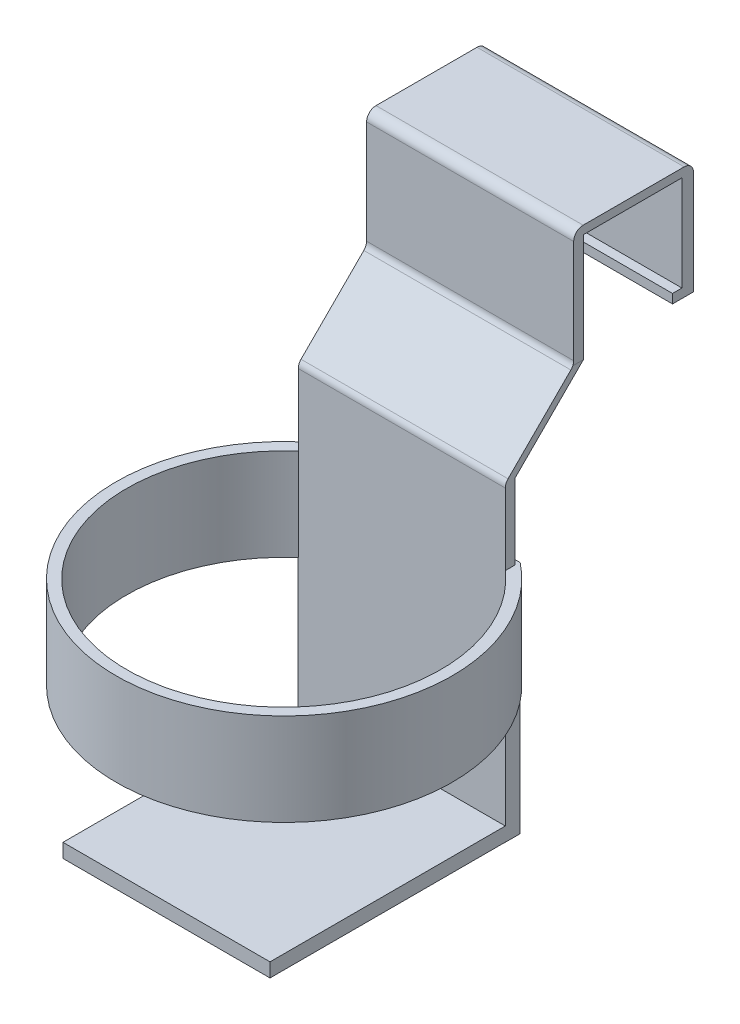
ISO-10303-21;
HEADER;
FILE_DESCRIPTION(('STEP AP214'),'2;1');
FILE_NAME('part.step','',(''),(''),'','','');
FILE_SCHEMA(('AUTOMOTIVE_DESIGN { 1 0 10303 214 1 1 1 1 }'));
ENDSEC;
DATA;
#1=APPLICATION_CONTEXT('core data for automotive mechanical design processes');
#2=APPLICATION_PROTOCOL_DEFINITION('international standard','automotive_design',2000,#1);
#3=PRODUCT_CONTEXT('',#1,'mechanical');
#4=PRODUCT('Part','Part','',(#3));
#5=PRODUCT_RELATED_PRODUCT_CATEGORY('part','',(#4));
#6=PRODUCT_DEFINITION_FORMATION('','',#4);
#7=PRODUCT_DEFINITION_CONTEXT('part definition',#1,'design');
#8=PRODUCT_DEFINITION('design','',#6,#7);
#9=PRODUCT_DEFINITION_SHAPE('','',#8);
#10=(LENGTH_UNIT() NAMED_UNIT(*) SI_UNIT(.MILLI.,.METRE.));
#11=(NAMED_UNIT(*) PLANE_ANGLE_UNIT() SI_UNIT($,.RADIAN.));
#12=(NAMED_UNIT(*) SI_UNIT($,.STERADIAN.) SOLID_ANGLE_UNIT());
#13=UNCERTAINTY_MEASURE_WITH_UNIT(LENGTH_MEASURE(1.E-05),#10,'distance_accuracy_value','');
#14=(GEOMETRIC_REPRESENTATION_CONTEXT(3) GLOBAL_UNCERTAINTY_ASSIGNED_CONTEXT((#13)) GLOBAL_UNIT_ASSIGNED_CONTEXT((#10,
#11,#12)) REPRESENTATION_CONTEXT('',''));
#15=CARTESIAN_POINT('',(0.,0.,0.));
#16=DIRECTION('',(0.,0.,1.));
#17=DIRECTION('',(1.,0.,0.));
#18=AXIS2_PLACEMENT_3D('',#15,#16,#17);
#19=CARTESIAN_POINT('',(0.,36.83,0.));
#20=DIRECTION('',(0.,0.,-1.));
#21=DIRECTION('',(-1.,0.,0.));
#22=AXIS2_PLACEMENT_3D('',#19,#20,#21);
#23=PLANE('',#22);
#24=DIRECTION('',(-1.,0.,0.));
#25=VECTOR('',#24,1.);
#26=CARTESIAN_POINT('',(55.9018002723752,8.81079470941692,0.));
#27=LINE('',#26,#25);
#28=CARTESIAN_POINT('',(55.9018002723752,8.81079470941692,0.));
#29=VERTEX_POINT('',#28);
#30=CARTESIAN_POINT('',(0.,8.81079470941692,0.));
#31=VERTEX_POINT('',#30);
#32=EDGE_CURVE('E251',#29,#31,#27,.T.);
#33=ORIENTED_EDGE('',*,*,#32,.F.);
#34=DIRECTION('',(0.,-1.,0.));
#35=VECTOR('',#34,1.);
#36=CARTESIAN_POINT('',(55.9018002723752,36.83,0.));
#37=LINE('',#36,#35);
#38=CARTESIAN_POINT('',(55.9018002723752,34.5712890129582,0.));
#39=VERTEX_POINT('',#38);
#40=EDGE_CURVE('E258',#39,#29,#37,.T.);
#41=ORIENTED_EDGE('',*,*,#40,.F.);
#42=DIRECTION('',(1.,0.,0.));
#43=VECTOR('',#42,1.);
#44=CARTESIAN_POINT('',(0.,34.5712890129582,0.));
#45=LINE('',#44,#43);
#46=CARTESIAN_POINT('',(0.,34.5712890129582,0.));
#47=VERTEX_POINT('',#46);
#48=EDGE_CURVE('E363',#47,#39,#45,.T.);
#49=ORIENTED_EDGE('',*,*,#48,.F.);
#50=DIRECTION('',(0.,-1.,0.));
#51=VECTOR('',#50,1.);
#52=CARTESIAN_POINT('',(0.,36.83,0.));
#53=LINE('',#52,#51);
#54=EDGE_CURVE('E352',#47,#31,#53,.T.);
#55=ORIENTED_EDGE('',*,*,#54,.T.);
#56=EDGE_LOOP('',(#33,#41,#49,#55));
#57=FACE_BOUND('',#56,.T.);
#58=ADVANCED_FACE('F38',(#57),#23,.F.);
#59=CARTESIAN_POINT('',(0.,-96.9016690600116,47.6529580729699));
#60=DIRECTION('',(0.,0.,-1.));
#61=DIRECTION('',(-1.,0.,0.));
#62=AXIS2_PLACEMENT_3D('',#59,#60,#61);
#63=PLANE('',#62);
#64=DIRECTION('',(0.,1.,0.));
#65=VECTOR('',#64,1.);
#66=CARTESIAN_POINT('',(55.88,-96.9016690600116,47.6529580729699));
#67=LINE('',#66,#65);
#68=CARTESIAN_POINT('',(55.88,-33.4332787004745,47.6529580729699));
#69=VERTEX_POINT('',#68);
#70=CARTESIAN_POINT('',(55.88,-14.1337715084392,47.6529580729699));
#71=VERTEX_POINT('',#70);
#72=EDGE_CURVE('E400',#69,#71,#67,.T.);
#73=ORIENTED_EDGE('',*,*,#72,.T.);
#74=DIRECTION('',(-1.,0.,0.));
#75=VECTOR('',#74,1.);
#76=CARTESIAN_POINT('',(0.,-14.1337715084392,47.6529580729699));
#77=LINE('',#76,#75);
#78=CARTESIAN_POINT('',(0.,-14.1337715084392,47.6529580729699));
#79=VERTEX_POINT('',#78);
#80=EDGE_CURVE('E462',#71,#79,#77,.T.);
#81=ORIENTED_EDGE('',*,*,#80,.T.);
#82=DIRECTION('',(0.,1.,0.));
#83=VECTOR('',#82,1.);
#84=CARTESIAN_POINT('',(0.,-96.9016690600116,47.6529580729699));
#85=LINE('',#84,#83);
#86=CARTESIAN_POINT('',(0.,-33.4332787004745,47.6529580729699));
#87=VERTEX_POINT('',#86);
#88=EDGE_CURVE('E367',#87,#79,#85,.T.);
#89=ORIENTED_EDGE('',*,*,#88,.F.);
#90=DIRECTION('',(0.,1.,0.));
#91=VECTOR('',#90,1.);
#92=CARTESIAN_POINT('',(0.,-93.1232787004745,47.6529580729699));
#93=LINE('',#92,#91);
#94=CARTESIAN_POINT('',(0.,-58.3252787004746,47.6529580729699));
#95=VERTEX_POINT('',#94);
#96=EDGE_CURVE('E414',#95,#87,#93,.T.);
#97=ORIENTED_EDGE('',*,*,#96,.F.);
#98=DIRECTION('',(-1.,0.,0.));
#99=VECTOR('',#98,1.);
#100=CARTESIAN_POINT('',(-0.112252849033479,-58.3252787004745,47.6529580729699));
#101=LINE('',#100,#99);
#102=CARTESIAN_POINT('',(-0.112252849033479,-58.3252787004745,47.6529580729699));
#103=VERTEX_POINT('',#102);
#104=EDGE_CURVE('E314',#95,#103,#101,.T.);
#105=ORIENTED_EDGE('',*,*,#104,.T.);
#106=DIRECTION('',(0.,1.,0.));
#107=VECTOR('',#106,1.);
#108=CARTESIAN_POINT('',(-0.112252849033479,-96.9332787004745,47.6529580729699));
#109=LINE('',#108,#107);
#110=CARTESIAN_POINT('',(-0.112252849033479,-96.9332787004745,47.6529580729699));
#111=VERTEX_POINT('',#110);
#112=EDGE_CURVE('E309',#111,#103,#109,.T.);
#113=ORIENTED_EDGE('',*,*,#112,.F.);
#114=DIRECTION('',(-1.,0.,0.));
#115=VECTOR('',#114,1.);
#116=CARTESIAN_POINT('',(-0.112252849033479,-96.9332787004745,47.6529580729699));
#117=LINE('',#116,#115);
#118=CARTESIAN_POINT('',(55.88,-96.9332787004745,47.6529580729699));
#119=VERTEX_POINT('',#118);
#120=EDGE_CURVE('E307',#119,#111,#117,.T.);
#121=ORIENTED_EDGE('',*,*,#120,.F.);
#122=DIRECTION('',(0.,1.,0.));
#123=VECTOR('',#122,1.);
#124=CARTESIAN_POINT('',(55.88,-96.9332787004745,47.6529580729699));
#125=LINE('',#124,#123);
#126=CARTESIAN_POINT('',(55.88,-96.9016690600116,47.6529580729699));
#127=VERTEX_POINT('',#126);
#128=EDGE_CURVE('E322',#119,#127,#125,.T.);
#129=ORIENTED_EDGE('',*,*,#128,.T.);
#130=DIRECTION('',(1.,0.,0.));
#131=VECTOR('',#130,1.);
#132=CARTESIAN_POINT('',(0.,-96.9016690600116,47.6529580729699));
#133=LINE('',#132,#131);
#134=CARTESIAN_POINT('',(0.,-96.9016690600116,47.6529580729699));
#135=VERTEX_POINT('',#134);
#136=EDGE_CURVE('E296',#135,#127,#133,.T.);
#137=ORIENTED_EDGE('',*,*,#136,.F.);
#138=DIRECTION('',(0.,1.,0.));
#139=VECTOR('',#138,1.);
#140=CARTESIAN_POINT('',(0.,-96.9016690600116,47.6529580729699));
#141=LINE('',#140,#139);
#142=CARTESIAN_POINT('',(0.,-93.1232787004745,47.6529580729699));
#143=VERTEX_POINT('',#142);
#144=EDGE_CURVE('E317',#135,#143,#141,.T.);
#145=ORIENTED_EDGE('',*,*,#144,.T.);
#146=DIRECTION('',(1.,0.,0.));
#147=VECTOR('',#146,1.);
#148=CARTESIAN_POINT('',(0.,-93.1232787004745,47.6529580729699));
#149=LINE('',#148,#147);
#150=CARTESIAN_POINT('',(55.88,-93.1232787004745,47.6529580729699));
#151=VERTEX_POINT('',#150);
#152=EDGE_CURVE('E293',#143,#151,#149,.T.);
#153=ORIENTED_EDGE('',*,*,#152,.T.);
#154=CARTESIAN_POINT('',(55.88,-58.3252787004745,47.6529580729699));
#155=VERTEX_POINT('',#154);
#156=EDGE_CURVE('E321',#151,#155,#125,.T.);
#157=ORIENTED_EDGE('',*,*,#156,.T.);
#158=DIRECTION('',(0.,1.,0.));
#159=VECTOR('',#158,1.);
#160=CARTESIAN_POINT('',(55.88,-93.1232787004745,47.6529580729699));
#161=LINE('',#160,#159);
#162=EDGE_CURVE('E331',#155,#69,#161,.T.);
#163=ORIENTED_EDGE('',*,*,#162,.T.);
#164=EDGE_LOOP('',(#73,#81,#89,#97,#105,#113,#121,#129,#137,#145,#153,#157,#163));
#165=FACE_BOUND('',#164,.T.);
#166=ADVANCED_FACE('F468',(#165),#63,.F.);
#167=CARTESIAN_POINT('',(27.94,-33.4332787004745,79.4029580729699));
#168=DIRECTION('',(0.,-1.,0.));
#169=DIRECTION('',(0.,0.,-1.));
#170=AXIS2_PLACEMENT_3D('',#167,#168,#169);
#171=CYLINDRICAL_SURFACE('',#170,45.3659299211627);
#172=CARTESIAN_POINT('',(27.94,-58.3252787004745,79.4029580729699));
#173=DIRECTION('',(0.,-1.,0.));
#174=DIRECTION('',(0.,0.,-1.));
#175=AXIS2_PLACEMENT_3D('',#172,#173,#174);
#176=CIRCLE('',#175,45.3659299211627);
#177=CARTESIAN_POINT('',(55.9922528490336,-58.3252787004745,43.7499258357851));
#178=VERTEX_POINT('',#177);
#179=CARTESIAN_POINT('',(-0.112252849033479,-58.3252787004746,43.7499258357851));
#180=VERTEX_POINT('',#179);
#181=EDGE_CURVE('E334',#178,#180,#176,.T.);
#182=ORIENTED_EDGE('',*,*,#181,.F.);
#183=DIRECTION('',(0.,1.,0.));
#184=VECTOR('',#183,1.);
#185=CARTESIAN_POINT('',(55.9922528490336,-93.1232787004745,43.7499258357851));
#186=LINE('',#185,#184);
#187=CARTESIAN_POINT('',(55.9922528490336,-33.4332787004745,43.7499258357851));
#188=VERTEX_POINT('',#187);
#189=EDGE_CURVE('E403',#178,#188,#186,.T.);
#190=ORIENTED_EDGE('',*,*,#189,.T.);
#191=CARTESIAN_POINT('',(27.94,-33.4332787004745,79.4029580729699));
#192=DIRECTION('',(0.,1.,0.));
#193=DIRECTION('',(0.,0.,1.));
#194=AXIS2_PLACEMENT_3D('',#191,#192,#193);
#195=CIRCLE('',#194,45.3659299211627);
#196=CARTESIAN_POINT('',(-0.112252849033479,-33.4332787004745,43.7499258357851));
#197=VERTEX_POINT('',#196);
#198=EDGE_CURVE('E408',#197,#188,#195,.T.);
#199=ORIENTED_EDGE('',*,*,#198,.F.);
#200=DIRECTION('',(0.,1.,0.));
#201=VECTOR('',#200,1.);
#202=CARTESIAN_POINT('',(-0.112252849033479,-93.1232787004745,43.7499258357851));
#203=LINE('',#202,#201);
#204=EDGE_CURVE('E419',#180,#197,#203,.T.);
#205=ORIENTED_EDGE('',*,*,#204,.F.);
#206=EDGE_LOOP('',(#182,#190,#199,#205));
#207=FACE_BOUND('',#206,.T.);
#208=ADVANCED_FACE('F521',(#207),#171,.T.);
#209=CARTESIAN_POINT('',(27.94,-93.1232787004745,79.5153793578999));
#210=DIRECTION('',(0.,1.,0.));
#211=DIRECTION('',(0.,0.,1.));
#212=AXIS2_PLACEMENT_3D('',#209,#210,#211);
#213=CYLINDRICAL_SURFACE('',#212,42.3775588034323);
#214=CARTESIAN_POINT('',(27.94,-58.3252787004745,79.5153793578999));
#215=DIRECTION('',(0.,-1.,0.));
#216=DIRECTION('',(0.,0.,-1.));
#217=AXIS2_PLACEMENT_3D('',#214,#215,#216);
#218=CIRCLE('',#217,42.3775588034323);
#219=EDGE_CURVE('E318',#95,#155,#218,.F.);
#220=ORIENTED_EDGE('',*,*,#219,.F.);
#221=ORIENTED_EDGE('',*,*,#96,.T.);
#222=CARTESIAN_POINT('',(27.94,-33.4332787004745,79.5153793578999));
#223=DIRECTION('',(0.,1.,0.));
#224=DIRECTION('',(0.,0.,1.));
#225=AXIS2_PLACEMENT_3D('',#222,#223,#224);
#226=CIRCLE('',#225,42.3775588034323);
#227=EDGE_CURVE('E416',#87,#69,#226,.T.);
#228=ORIENTED_EDGE('',*,*,#227,.T.);
#229=ORIENTED_EDGE('',*,*,#162,.F.);
#230=EDGE_LOOP('',(#220,#221,#228,#229));
#231=FACE_BOUND('',#230,.T.);
#232=ADVANCED_FACE('F548',(#231),#213,.F.);
#233=CARTESIAN_POINT('',(-0.112252849033479,-93.1232787004745,43.7499258357851));
#234=DIRECTION('',(0.,0.,1.));
#235=DIRECTION('',(1.,0.,0.));
#236=AXIS2_PLACEMENT_3D('',#233,#234,#235);
#237=PLANE('',#236);
#238=DIRECTION('',(1.,0.,0.));
#239=VECTOR('',#238,1.);
#240=CARTESIAN_POINT('',(-0.112252849033479,-58.3252787004745,43.7499258357851));
#241=LINE('',#240,#239);
#242=CARTESIAN_POINT('',(55.8800000000001,-58.3252787004745,43.7499258357851));
#243=VERTEX_POINT('',#242);
#244=EDGE_CURVE('E332',#243,#178,#241,.T.);
#245=ORIENTED_EDGE('',*,*,#244,.F.);
#246=DIRECTION('',(0.,1.,0.));
#247=VECTOR('',#246,1.);
#248=CARTESIAN_POINT('',(55.88,-96.9332787004745,43.7499258357851));
#249=LINE('',#248,#247);
#250=CARTESIAN_POINT('',(55.88,-96.9332787004745,43.7499258357851));
#251=VERTEX_POINT('',#250);
#252=EDGE_CURVE('E325',#251,#243,#249,.T.);
#253=ORIENTED_EDGE('',*,*,#252,.F.);
#254=DIRECTION('',(1.,0.,0.));
#255=VECTOR('',#254,1.);
#256=CARTESIAN_POINT('',(-0.112252849033479,-96.9332787004745,43.7499258357851));
#257=LINE('',#256,#255);
#258=CARTESIAN_POINT('',(-0.112252849033479,-96.9332787004745,43.7499258357851));
#259=VERTEX_POINT('',#258);
#260=EDGE_CURVE('E302',#259,#251,#257,.T.);
#261=ORIENTED_EDGE('',*,*,#260,.F.);
#262=DIRECTION('',(0.,1.,0.));
#263=VECTOR('',#262,1.);
#264=CARTESIAN_POINT('',(-0.112252849033479,-96.9332787004745,43.7499258357851));
#265=LINE('',#264,#263);
#266=EDGE_CURVE('E328',#259,#180,#265,.T.);
#267=ORIENTED_EDGE('',*,*,#266,.T.);
#268=ORIENTED_EDGE('',*,*,#204,.T.);
#269=DIRECTION('',(1.,0.,0.));
#270=VECTOR('',#269,1.);
#271=CARTESIAN_POINT('',(-0.112252849033479,-33.4332787004745,43.7499258357851));
#272=LINE('',#271,#270);
#273=EDGE_CURVE('E355',#197,#188,#272,.T.);
#274=ORIENTED_EDGE('',*,*,#273,.T.);
#275=ORIENTED_EDGE('',*,*,#189,.F.);
#276=EDGE_LOOP('',(#245,#253,#261,#267,#268,#274,#275));
#277=FACE_BOUND('',#276,.T.);
#278=ADVANCED_FACE('F534',(#277),#237,.F.);
#279=CARTESIAN_POINT('',(0.,34.5712890129582,29.21));
#280=DIRECTION('',(0.,1.,0.));
#281=DIRECTION('',(0.,0.,1.));
#282=AXIS2_PLACEMENT_3D('',#279,#280,#281);
#283=PLANE('',#282);
#284=DIRECTION('',(0.,0.,-1.));
#285=VECTOR('',#284,1.);
#286=CARTESIAN_POINT('',(55.9018002723752,34.5712890129582,29.21));
#287=LINE('',#286,#285);
#288=CARTESIAN_POINT('',(55.9018002723752,34.5712890129582,26.5535243040915));
#289=VERTEX_POINT('',#288);
#290=EDGE_CURVE('E351',#289,#39,#287,.T.);
#291=ORIENTED_EDGE('',*,*,#290,.F.);
#292=DIRECTION('',(1.,0.,0.));
#293=VECTOR('',#292,1.);
#294=CARTESIAN_POINT('',(0.,34.5712890129582,26.5535243040915));
#295=LINE('',#294,#293);
#296=CARTESIAN_POINT('',(0.,34.5712890129582,26.5535243040915));
#297=VERTEX_POINT('',#296);
#298=EDGE_CURVE('E375',#297,#289,#295,.T.);
#299=ORIENTED_EDGE('',*,*,#298,.F.);
#300=DIRECTION('',(0.,0.,-1.));
#301=VECTOR('',#300,1.);
#302=CARTESIAN_POINT('',(0.,34.5712890129582,29.21));
#303=LINE('',#302,#301);
#304=EDGE_CURVE('E354',#297,#47,#303,.T.);
#305=ORIENTED_EDGE('',*,*,#304,.T.);
#306=ORIENTED_EDGE('',*,*,#48,.T.);
#307=EDGE_LOOP('',(#291,#299,#305,#306));
#308=FACE_BOUND('',#307,.T.);
#309=ADVANCED_FACE('F531',(#308),#283,.F.);
#310=CARTESIAN_POINT('',(0.,36.83,0.));
#311=DIRECTION('',(-1.,0.,0.));
#312=DIRECTION('',(0.,0.,1.));
#313=AXIS2_PLACEMENT_3D('',#310,#311,#312);
#314=PLANE('',#313);
#315=ORIENTED_EDGE('',*,*,#88,.T.);
#316=CARTESIAN_POINT('',(0.,-14.1337715084392,45.1129580729699));
#317=DIRECTION('',(-1.,0.,0.));
#318=DIRECTION('',(0.,0.,1.));
#319=AXIS2_PLACEMENT_3D('',#316,#317,#318);
#320=CIRCLE('',#319,2.54);
#321=CARTESIAN_POINT('',(0.,-12.3377202842254,46.9090092971838));
#322=VERTEX_POINT('',#321);
#323=EDGE_CURVE('E60',#79,#322,#320,.T.);
#324=ORIENTED_EDGE('',*,*,#323,.T.);
#325=DIRECTION('',(0.,0.707106781186544,-0.707106781186552));
#326=VECTOR('',#325,1.);
#327=CARTESIAN_POINT('',(0.,5.36128901295812,29.21));
#328=LINE('',#327,#326);
#329=CARTESIAN_POINT('',(0.,4.61734023717196,29.9539487757862));
#330=VERTEX_POINT('',#329);
#331=EDGE_CURVE('E361',#322,#330,#328,.T.);
#332=ORIENTED_EDGE('',*,*,#331,.T.);
#333=CARTESIAN_POINT('',(0.,6.4133914613858,31.75));
#334=DIRECTION('',(-1.,0.,0.));
#335=DIRECTION('',(0.,0.,1.));
#336=AXIS2_PLACEMENT_3D('',#333,#334,#335);
#337=CIRCLE('',#336,2.54);
#338=CARTESIAN_POINT('',(0.,6.4133914613858,29.21));
#339=VERTEX_POINT('',#338);
#340=EDGE_CURVE('E457',#330,#339,#337,.F.);
#341=ORIENTED_EDGE('',*,*,#340,.T.);
#342=DIRECTION('',(0.,-1.,0.));
#343=VECTOR('',#342,1.);
#344=CARTESIAN_POINT('',(0.,36.83,29.21));
#345=LINE('',#344,#343);
#346=CARTESIAN_POINT('',(0.,34.29,29.21));
#347=VERTEX_POINT('',#346);
#348=EDGE_CURVE('E358',#347,#339,#345,.T.);
#349=ORIENTED_EDGE('',*,*,#348,.F.);
#350=CARTESIAN_POINT('',(0.,34.29,26.67));
#351=DIRECTION('',(-1.,0.,0.));
#352=DIRECTION('',(0.,0.,1.));
#353=AXIS2_PLACEMENT_3D('',#350,#351,#352);
#354=CIRCLE('',#353,2.54);
#355=CARTESIAN_POINT('',(0.,36.83,26.67));
#356=VERTEX_POINT('',#355);
#357=EDGE_CURVE('E436',#347,#356,#354,.T.);
#358=ORIENTED_EDGE('',*,*,#357,.T.);
#359=DIRECTION('',(0.,0.,-1.));
#360=VECTOR('',#359,1.);
#361=CARTESIAN_POINT('',(0.,36.83,0.));
#362=LINE('',#361,#360);
#363=CARTESIAN_POINT('',(0.,36.83,-0.597316851507421));
#364=VERTEX_POINT('',#363);
#365=EDGE_CURVE('E346',#356,#364,#362,.T.);
#366=ORIENTED_EDGE('',*,*,#365,.T.);
#367=CARTESIAN_POINT('',(0.,34.29,-0.597316851507421));
#368=DIRECTION('',(-1.,0.,0.));
#369=DIRECTION('',(0.,0.,1.));
#370=AXIS2_PLACEMENT_3D('',#367,#368,#369);
#371=CIRCLE('',#370,2.54);
#372=CARTESIAN_POINT('',(0.,34.29,-3.13731685150742));
#373=VERTEX_POINT('',#372);
#374=EDGE_CURVE('E434',#364,#373,#371,.T.);
#375=ORIENTED_EDGE('',*,*,#374,.T.);
#376=DIRECTION('',(0.,-1.,0.));
#377=VECTOR('',#376,1.);
#378=CARTESIAN_POINT('',(0.,36.83,-3.13731685150742));
#379=LINE('',#378,#377);
#380=CARTESIAN_POINT('',(0.,6.35,-3.13731685150742));
#381=VERTEX_POINT('',#380);
#382=EDGE_CURVE('E343',#373,#381,#379,.T.);
#383=ORIENTED_EDGE('',*,*,#382,.T.);
#384=DIRECTION('',(0.,0.,-1.));
#385=VECTOR('',#384,1.);
#386=CARTESIAN_POINT('',(0.,6.35,3.80999999999998));
#387=LINE('',#386,#385);
#388=CARTESIAN_POINT('',(0.,6.35,2.54));
#389=VERTEX_POINT('',#388);
#390=EDGE_CURVE('E261',#389,#381,#387,.T.);
#391=ORIENTED_EDGE('',*,*,#390,.F.);
#392=DIRECTION('',(0.,-1.,0.));
#393=VECTOR('',#392,1.);
#394=CARTESIAN_POINT('',(0.,6.35,2.54));
#395=LINE('',#394,#393);
#396=CARTESIAN_POINT('',(0.,8.81079470941692,2.54));
#397=VERTEX_POINT('',#396);
#398=EDGE_CURVE('E241',#397,#389,#395,.T.);
#399=ORIENTED_EDGE('',*,*,#398,.F.);
#400=DIRECTION('',(0.,0.,-1.));
#401=VECTOR('',#400,1.);
#402=CARTESIAN_POINT('',(0.,8.81079470941692,2.54));
#403=LINE('',#402,#401);
#404=EDGE_CURVE('E237',#397,#31,#403,.T.);
#405=ORIENTED_EDGE('',*,*,#404,.T.);
#406=ORIENTED_EDGE('',*,*,#54,.F.);
#407=ORIENTED_EDGE('',*,*,#304,.F.);
#408=DIRECTION('',(0.,1.,0.));
#409=VECTOR('',#408,1.);
#410=CARTESIAN_POINT('',(0.,5.36128901295812,26.5535243040915));
#411=LINE('',#410,#409);
#412=CARTESIAN_POINT('',(0.,5.36128901295812,26.5535243040915));
#413=VERTEX_POINT('',#412);
#414=EDGE_CURVE('E371',#413,#297,#411,.T.);
#415=ORIENTED_EDGE('',*,*,#414,.F.);
#416=DIRECTION('',(0.,-0.707106781186549,0.707106781186546));
#417=VECTOR('',#416,1.);
#418=CARTESIAN_POINT('',(0.,-13.0816690600115,44.9964823770611));
#419=LINE('',#418,#417);
#420=CARTESIAN_POINT('',(0.,-13.0816690600115,44.9964823770611));
#421=VERTEX_POINT('',#420);
#422=EDGE_CURVE('E345',#413,#421,#419,.T.);
#423=ORIENTED_EDGE('',*,*,#422,.T.);
#424=DIRECTION('',(0.,1.,0.));
#425=VECTOR('',#424,1.);
#426=CARTESIAN_POINT('',(0.,-96.9016690600116,44.9964823770611));
#427=LINE('',#426,#425);
#428=CARTESIAN_POINT('',(0.,-33.4332787004746,44.9964823770611));
#429=VERTEX_POINT('',#428);
#430=EDGE_CURVE('E338',#429,#421,#427,.T.);
#431=ORIENTED_EDGE('',*,*,#430,.F.);
#432=DIRECTION('',(0.,0.,-1.));
#433=VECTOR('',#432,1.);
#434=CARTESIAN_POINT('',(0.,-33.4332787004745,0.));
#435=LINE('',#434,#433);
#436=EDGE_CURVE('E405',#87,#429,#435,.T.);
#437=ORIENTED_EDGE('',*,*,#436,.F.);
#438=EDGE_LOOP('',(#315,#324,#332,#341,#349,#358,#366,#375,#383,#391,#399,#405,#406,#407,#415,
#423,#431,#437));
#439=FACE_BOUND('',#438,.T.);
#440=ADVANCED_FACE('F474',(#439),#314,.T.);
#441=CARTESIAN_POINT('',(55.9018002723752,36.83,0.));
#442=DIRECTION('',(-1.,0.,0.));
#443=DIRECTION('',(0.,0.,1.));
#444=AXIS2_PLACEMENT_3D('',#441,#442,#443);
#445=PLANE('',#444);
#446=DIRECTION('',(0.,0.,-1.));
#447=VECTOR('',#446,1.);
#448=CARTESIAN_POINT('',(55.9018002723752,36.83,0.));
#449=LINE('',#448,#447);
#450=CARTESIAN_POINT('',(55.9018002723752,36.83,26.67));
#451=VERTEX_POINT('',#450);
#452=CARTESIAN_POINT('',(55.9018002723752,36.83,-0.597316851507421));
#453=VERTEX_POINT('',#452);
#454=EDGE_CURVE('E349',#451,#453,#449,.T.);
#455=ORIENTED_EDGE('',*,*,#454,.F.);
#456=CARTESIAN_POINT('',(55.9018002723752,34.29,26.67));
#457=DIRECTION('',(-1.,0.,0.));
#458=DIRECTION('',(0.,0.,1.));
#459=AXIS2_PLACEMENT_3D('',#456,#457,#458);
#460=CIRCLE('',#459,2.54);
#461=CARTESIAN_POINT('',(55.9018002723752,34.29,29.21));
#462=VERTEX_POINT('',#461);
#463=EDGE_CURVE('E444',#451,#462,#460,.F.);
#464=ORIENTED_EDGE('',*,*,#463,.T.);
#465=DIRECTION('',(0.,1.,0.));
#466=VECTOR('',#465,1.);
#467=CARTESIAN_POINT('',(55.9018002723752,36.83,29.21));
#468=LINE('',#467,#466);
#469=CARTESIAN_POINT('',(55.9018002723752,5.36128901295812,29.21));
#470=VERTEX_POINT('',#469);
#471=EDGE_CURVE('E368',#470,#462,#468,.T.);
#472=ORIENTED_EDGE('',*,*,#471,.F.);
#473=DIRECTION('',(0.,0.,1.));
#474=VECTOR('',#473,1.);
#475=CARTESIAN_POINT('',(55.9018002723752,5.36128901295812,29.21));
#476=LINE('',#475,#474);
#477=CARTESIAN_POINT('',(55.9018002723752,5.36128901295812,26.5535243040915));
#478=VERTEX_POINT('',#477);
#479=EDGE_CURVE('E384',#478,#470,#476,.T.);
#480=ORIENTED_EDGE('',*,*,#479,.F.);
#481=DIRECTION('',(0.,1.,0.));
#482=VECTOR('',#481,1.);
#483=CARTESIAN_POINT('',(55.9018002723752,5.36128901295812,26.5535243040915));
#484=LINE('',#483,#482);
#485=EDGE_CURVE('E365',#478,#289,#484,.T.);
#486=ORIENTED_EDGE('',*,*,#485,.T.);
#487=ORIENTED_EDGE('',*,*,#290,.T.);
#488=ORIENTED_EDGE('',*,*,#40,.T.);
#489=DIRECTION('',(0.,0.,-1.));
#490=VECTOR('',#489,1.);
#491=CARTESIAN_POINT('',(55.9018002723752,8.81079470941692,2.54));
#492=LINE('',#491,#490);
#493=CARTESIAN_POINT('',(55.9018002723752,8.81079470941692,2.54));
#494=VERTEX_POINT('',#493);
#495=EDGE_CURVE('E235',#494,#29,#492,.T.);
#496=ORIENTED_EDGE('',*,*,#495,.F.);
#497=DIRECTION('',(0.,1.,0.));
#498=VECTOR('',#497,1.);
#499=CARTESIAN_POINT('',(55.9018002723752,6.35,2.54));
#500=LINE('',#499,#498);
#501=CARTESIAN_POINT('',(55.9018002723752,6.35,2.54));
#502=VERTEX_POINT('',#501);
#503=EDGE_CURVE('E242',#502,#494,#500,.T.);
#504=ORIENTED_EDGE('',*,*,#503,.F.);
#505=DIRECTION('',(0.,0.,1.));
#506=VECTOR('',#505,1.);
#507=CARTESIAN_POINT('',(55.9018002723752,6.35,3.80999999999998));
#508=LINE('',#507,#506);
#509=CARTESIAN_POINT('',(55.9018002723752,6.35,-3.13731685150742));
#510=VERTEX_POINT('',#509);
#511=EDGE_CURVE('E259',#510,#502,#508,.T.);
#512=ORIENTED_EDGE('',*,*,#511,.F.);
#513=DIRECTION('',(0.,-1.,0.));
#514=VECTOR('',#513,1.);
#515=CARTESIAN_POINT('',(55.9018002723752,36.83,-3.13731685150742));
#516=LINE('',#515,#514);
#517=CARTESIAN_POINT('',(55.9018002723752,34.29,-3.13731685150742));
#518=VERTEX_POINT('',#517);
#519=EDGE_CURVE('E347',#518,#510,#516,.T.);
#520=ORIENTED_EDGE('',*,*,#519,.F.);
#521=CARTESIAN_POINT('',(55.9018002723752,34.29,-0.597316851507421));
#522=DIRECTION('',(-1.,0.,0.));
#523=DIRECTION('',(0.,0.,1.));
#524=AXIS2_PLACEMENT_3D('',#521,#522,#523);
#525=CIRCLE('',#524,2.54);
#526=EDGE_CURVE('E442',#518,#453,#525,.F.);
#527=ORIENTED_EDGE('',*,*,#526,.T.);
#528=EDGE_LOOP('',(#455,#464,#472,#480,#486,#487,#488,#496,#504,#512,#520,#527));
#529=FACE_BOUND('',#528,.T.);
#530=ADVANCED_FACE('F255',(#529),#445,.F.);
#531=CARTESIAN_POINT('',(0.,36.83,-3.13731685150742));
#532=DIRECTION('',(0.,0.,-1.));
#533=DIRECTION('',(-1.,0.,0.));
#534=AXIS2_PLACEMENT_3D('',#531,#532,#533);
#535=PLANE('',#534);
#536=ORIENTED_EDGE('',*,*,#382,.F.);
#537=DIRECTION('',(1.,0.,0.));
#538=VECTOR('',#537,1.);
#539=CARTESIAN_POINT('',(55.9018002723752,34.29,-3.13731685150742));
#540=LINE('',#539,#538);
#541=EDGE_CURVE('E446',#373,#518,#540,.T.);
#542=ORIENTED_EDGE('',*,*,#541,.T.);
#543=ORIENTED_EDGE('',*,*,#519,.T.);
#544=DIRECTION('',(1.,0.,0.));
#545=VECTOR('',#544,1.);
#546=CARTESIAN_POINT('',(55.9018002723752,6.35,-3.13731685150742));
#547=LINE('',#546,#545);
#548=EDGE_CURVE('E268',#381,#510,#547,.T.);
#549=ORIENTED_EDGE('',*,*,#548,.F.);
#550=EDGE_LOOP('',(#536,#542,#543,#549));
#551=FACE_BOUND('',#550,.T.);
#552=ADVANCED_FACE('F529',(#551),#535,.T.);
#553=CARTESIAN_POINT('',(0.,36.83,0.));
#554=DIRECTION('',(0.,-1.,0.));
#555=DIRECTION('',(0.,0.,-1.));
#556=AXIS2_PLACEMENT_3D('',#553,#554,#555);
#557=PLANE('',#556);
#558=ORIENTED_EDGE('',*,*,#365,.F.);
#559=DIRECTION('',(-1.,0.,0.));
#560=VECTOR('',#559,1.);
#561=CARTESIAN_POINT('',(55.9018002723752,36.83,26.67));
#562=LINE('',#561,#560);
#563=EDGE_CURVE('E440',#356,#451,#562,.F.);
#564=ORIENTED_EDGE('',*,*,#563,.T.);
#565=ORIENTED_EDGE('',*,*,#454,.T.);
#566=DIRECTION('',(1.,0.,0.));
#567=VECTOR('',#566,1.);
#568=CARTESIAN_POINT('',(0.,36.83,-0.597316851507421));
#569=LINE('',#568,#567);
#570=EDGE_CURVE('E438',#453,#364,#569,.F.);
#571=ORIENTED_EDGE('',*,*,#570,.T.);
#572=EDGE_LOOP('',(#558,#564,#565,#571));
#573=FACE_BOUND('',#572,.T.);
#574=ADVANCED_FACE('F526',(#573),#557,.F.);
#575=CARTESIAN_POINT('',(0.,0.,29.21));
#576=DIRECTION('',(0.,0.,1.));
#577=DIRECTION('',(1.,0.,0.));
#578=AXIS2_PLACEMENT_3D('',#575,#576,#577);
#579=PLANE('',#578);
#580=ORIENTED_EDGE('',*,*,#348,.T.);
#581=DIRECTION('',(-1.,0.,0.));
#582=VECTOR('',#581,1.);
#583=CARTESIAN_POINT('',(55.88,6.4133914613858,29.21));
#584=LINE('',#583,#582);
#585=CARTESIAN_POINT('',(55.88,6.4133914613858,29.21));
#586=VERTEX_POINT('',#585);
#587=EDGE_CURVE('E454',#339,#586,#584,.F.);
#588=ORIENTED_EDGE('',*,*,#587,.T.);
#589=DIRECTION('',(0.,-1.,0.));
#590=VECTOR('',#589,1.);
#591=CARTESIAN_POINT('',(55.88,0.,29.21));
#592=LINE('',#591,#590);
#593=CARTESIAN_POINT('',(55.88,5.36128901295812,29.21));
#594=VERTEX_POINT('',#593);
#595=EDGE_CURVE('E452',#586,#594,#592,.T.);
#596=ORIENTED_EDGE('',*,*,#595,.T.);
#597=DIRECTION('',(-1.,0.,0.));
#598=VECTOR('',#597,1.);
#599=CARTESIAN_POINT('',(0.,5.36128901295812,29.21));
#600=LINE('',#599,#598);
#601=EDGE_CURVE('E380',#470,#594,#600,.T.);
#602=ORIENTED_EDGE('',*,*,#601,.F.);
#603=ORIENTED_EDGE('',*,*,#471,.T.);
#604=DIRECTION('',(-1.,0.,0.));
#605=VECTOR('',#604,1.);
#606=CARTESIAN_POINT('',(0.,34.29,29.21));
#607=LINE('',#606,#605);
#608=EDGE_CURVE('E431',#462,#347,#607,.T.);
#609=ORIENTED_EDGE('',*,*,#608,.T.);
#610=EDGE_LOOP('',(#580,#588,#596,#602,#603,#609));
#611=FACE_BOUND('',#610,.T.);
#612=ADVANCED_FACE('F504',(#611),#579,.T.);
#613=CARTESIAN_POINT('',(0.,5.36128901295812,26.5535243040915));
#614=DIRECTION('',(0.,0.,1.));
#615=DIRECTION('',(1.,0.,0.));
#616=AXIS2_PLACEMENT_3D('',#613,#614,#615);
#617=PLANE('',#616);
#618=DIRECTION('',(1.,0.,0.));
#619=VECTOR('',#618,1.);
#620=CARTESIAN_POINT('',(0.,5.36128901295812,26.5535243040915));
#621=LINE('',#620,#619);
#622=CARTESIAN_POINT('',(55.88,5.36128901295812,26.5535243040915));
#623=VERTEX_POINT('',#622);
#624=EDGE_CURVE('E379',#623,#478,#621,.T.);
#625=ORIENTED_EDGE('',*,*,#624,.F.);
#626=EDGE_CURVE('E387',#413,#623,#621,.T.);
#627=ORIENTED_EDGE('',*,*,#626,.F.);
#628=ORIENTED_EDGE('',*,*,#414,.T.);
#629=ORIENTED_EDGE('',*,*,#298,.T.);
#630=ORIENTED_EDGE('',*,*,#485,.F.);
#631=EDGE_LOOP('',(#625,#627,#628,#629,#630));
#632=FACE_BOUND('',#631,.T.);
#633=ADVANCED_FACE('F493',(#632),#617,.F.);
#634=CARTESIAN_POINT('',(0.,5.36128901295812,0.));
#635=DIRECTION('',(0.,-1.,0.));
#636=DIRECTION('',(0.,0.,-1.));
#637=AXIS2_PLACEMENT_3D('',#634,#635,#636);
#638=PLANE('',#637);
#639=DIRECTION('',(0.,0.,1.));
#640=VECTOR('',#639,1.);
#641=CARTESIAN_POINT('',(55.88,5.36128901295812,0.));
#642=LINE('',#641,#640);
#643=EDGE_CURVE('E339',#623,#594,#642,.T.);
#644=ORIENTED_EDGE('',*,*,#643,.F.);
#645=ORIENTED_EDGE('',*,*,#624,.T.);
#646=ORIENTED_EDGE('',*,*,#479,.T.);
#647=ORIENTED_EDGE('',*,*,#601,.T.);
#648=EDGE_LOOP('',(#644,#645,#646,#647));
#649=FACE_BOUND('',#648,.T.);
#650=ADVANCED_FACE('F498',(#649),#638,.T.);
#651=CARTESIAN_POINT('',(55.88,5.36128901295812,29.21));
#652=DIRECTION('',(0.,0.707106781186551,0.707106781186543));
#653=DIRECTION('',(0.,-0.707106781186544,0.707106781186552));
#654=AXIS2_PLACEMENT_3D('',#651,#652,#653);
#655=PLANE('',#654);
#656=ORIENTED_EDGE('',*,*,#331,.F.);
#657=DIRECTION('',(-1.,0.,0.));
#658=VECTOR('',#657,1.);
#659=CARTESIAN_POINT('',(55.88,-12.3377202842254,46.9090092971838));
#660=LINE('',#659,#658);
#661=CARTESIAN_POINT('',(55.88,-12.3377202842254,46.9090092971838));
#662=VERTEX_POINT('',#661);
#663=EDGE_CURVE('E46',#322,#662,#660,.F.);
#664=ORIENTED_EDGE('',*,*,#663,.T.);
#665=DIRECTION('',(0.,0.707106781186544,-0.707106781186552));
#666=VECTOR('',#665,1.);
#667=CARTESIAN_POINT('',(55.88,5.36128901295812,29.21));
#668=LINE('',#667,#666);
#669=CARTESIAN_POINT('',(55.88,4.61734023717196,29.9539487757862));
#670=VERTEX_POINT('',#669);
#671=EDGE_CURVE('E383',#662,#670,#668,.T.);
#672=ORIENTED_EDGE('',*,*,#671,.T.);
#673=DIRECTION('',(-1.,0.,0.));
#674=VECTOR('',#673,1.);
#675=CARTESIAN_POINT('',(0.,4.61734023717196,29.9539487757862));
#676=LINE('',#675,#674);
#677=EDGE_CURVE('E449',#670,#330,#676,.T.);
#678=ORIENTED_EDGE('',*,*,#677,.T.);
#679=EDGE_LOOP('',(#656,#664,#672,#678));
#680=FACE_BOUND('',#679,.T.);
#681=ADVANCED_FACE('F509',(#680),#655,.T.);
#682=CARTESIAN_POINT('',(55.88,-13.0816690600115,44.9964823770611));
#683=DIRECTION('',(0.,-0.707106781186547,-0.707106781186549));
#684=DIRECTION('',(0.,0.707106781186549,-0.707106781186546));
#685=AXIS2_PLACEMENT_3D('',#682,#683,#684);
#686=PLANE('',#685);
#687=ORIENTED_EDGE('',*,*,#422,.F.);
#688=ORIENTED_EDGE('',*,*,#626,.T.);
#689=DIRECTION('',(0.,-0.707106781186549,0.707106781186546));
#690=VECTOR('',#689,1.);
#691=CARTESIAN_POINT('',(55.88,-13.0816690600115,44.9964823770611));
#692=LINE('',#691,#690);
#693=CARTESIAN_POINT('',(55.88,-13.0816690600115,44.9964823770611));
#694=VERTEX_POINT('',#693);
#695=EDGE_CURVE('E390',#623,#694,#692,.T.);
#696=ORIENTED_EDGE('',*,*,#695,.T.);
#697=DIRECTION('',(-1.,0.,0.));
#698=VECTOR('',#697,1.);
#699=CARTESIAN_POINT('',(55.88,-13.0816690600115,44.9964823770611));
#700=LINE('',#699,#698);
#701=EDGE_CURVE('E391',#694,#421,#700,.T.);
#702=ORIENTED_EDGE('',*,*,#701,.T.);
#703=EDGE_LOOP('',(#687,#688,#696,#702));
#704=FACE_BOUND('',#703,.T.);
#705=ADVANCED_FACE('F489',(#704),#686,.T.);
#706=CARTESIAN_POINT('',(55.88,0.,0.));
#707=DIRECTION('',(1.,0.,0.));
#708=DIRECTION('',(0.,0.,-1.));
#709=AXIS2_PLACEMENT_3D('',#706,#707,#708);
#710=PLANE('',#709);
#711=ORIENTED_EDGE('',*,*,#671,.F.);
#712=CARTESIAN_POINT('',(55.88,-14.1337715084392,45.1129580729699));
#713=DIRECTION('',(1.,0.,0.));
#714=DIRECTION('',(0.,0.,-1.));
#715=AXIS2_PLACEMENT_3D('',#712,#713,#714);
#716=CIRCLE('',#715,2.54);
#717=EDGE_CURVE('E11',#662,#71,#716,.T.);
#718=ORIENTED_EDGE('',*,*,#717,.T.);
#719=ORIENTED_EDGE('',*,*,#72,.F.);
#720=DIRECTION('',(0.,0.,1.));
#721=VECTOR('',#720,1.);
#722=CARTESIAN_POINT('',(55.88,-33.4332787004745,0.));
#723=LINE('',#722,#721);
#724=CARTESIAN_POINT('',(55.88,-33.4332787004746,44.9964823770611));
#725=VERTEX_POINT('',#724);
#726=EDGE_CURVE('E407',#725,#69,#723,.T.);
#727=ORIENTED_EDGE('',*,*,#726,.F.);
#728=DIRECTION('',(0.,1.,0.));
#729=VECTOR('',#728,1.);
#730=CARTESIAN_POINT('',(55.88,-96.9016690600116,44.9964823770611));
#731=LINE('',#730,#729);
#732=EDGE_CURVE('E342',#725,#694,#731,.T.);
#733=ORIENTED_EDGE('',*,*,#732,.T.);
#734=ORIENTED_EDGE('',*,*,#695,.F.);
#735=ORIENTED_EDGE('',*,*,#643,.T.);
#736=ORIENTED_EDGE('',*,*,#595,.F.);
#737=CARTESIAN_POINT('',(55.88,6.4133914613858,31.75));
#738=DIRECTION('',(1.,0.,0.));
#739=DIRECTION('',(0.,0.,-1.));
#740=AXIS2_PLACEMENT_3D('',#737,#738,#739);
#741=CIRCLE('',#740,2.54);
#742=EDGE_CURVE('E459',#586,#670,#741,.F.);
#743=ORIENTED_EDGE('',*,*,#742,.T.);
#744=EDGE_LOOP('',(#711,#718,#719,#727,#733,#734,#735,#736,#743));
#745=FACE_BOUND('',#744,.T.);
#746=ADVANCED_FACE('F486',(#745),#710,.T.);
#747=CARTESIAN_POINT('',(0.,-96.9016690600116,44.9964823770611));
#748=DIRECTION('',(0.,0.,1.));
#749=DIRECTION('',(1.,0.,0.));
#750=AXIS2_PLACEMENT_3D('',#747,#748,#749);
#751=PLANE('',#750);
#752=ORIENTED_EDGE('',*,*,#732,.F.);
#753=DIRECTION('',(-1.,0.,0.));
#754=VECTOR('',#753,1.);
#755=CARTESIAN_POINT('',(0.,-33.4332787004746,44.9964823770611));
#756=LINE('',#755,#754);
#757=EDGE_CURVE('E335',#725,#429,#756,.T.);
#758=ORIENTED_EDGE('',*,*,#757,.T.);
#759=ORIENTED_EDGE('',*,*,#430,.T.);
#760=ORIENTED_EDGE('',*,*,#701,.F.);
#761=EDGE_LOOP('',(#752,#758,#759,#760));
#762=FACE_BOUND('',#761,.T.);
#763=ADVANCED_FACE('F482',(#762),#751,.F.);
#764=CARTESIAN_POINT('',(27.94,-33.4332787004745,79.4029580729699));
#765=DIRECTION('',(0.,1.,0.));
#766=DIRECTION('',(0.,0.,1.));
#767=AXIS2_PLACEMENT_3D('',#764,#765,#766);
#768=PLANE('',#767);
#769=ORIENTED_EDGE('',*,*,#273,.F.);
#770=ORIENTED_EDGE('',*,*,#198,.T.);
#771=EDGE_LOOP('',(#769,#770));
#772=FACE_BOUND('',#771,.T.);
#773=ORIENTED_EDGE('',*,*,#227,.F.);
#774=ORIENTED_EDGE('',*,*,#436,.T.);
#775=ORIENTED_EDGE('',*,*,#757,.F.);
#776=ORIENTED_EDGE('',*,*,#726,.T.);
#777=EDGE_LOOP('',(#773,#774,#775,#776));
#778=FACE_BOUND('',#777,.T.);
#779=ADVANCED_FACE('F478',(#772,#778),#768,.T.);
#780=CARTESIAN_POINT('',(27.94,-58.3252787004745,84.2594069149589));
#781=DIRECTION('',(0.,-1.,0.));
#782=DIRECTION('',(0.,0.,-1.));
#783=AXIS2_PLACEMENT_3D('',#780,#781,#782);
#784=PLANE('',#783);
#785=DIRECTION('',(0.,0.,-1.));
#786=VECTOR('',#785,1.);
#787=CARTESIAN_POINT('',(-0.112252849033479,-58.3252787004745,43.7499258357851));
#788=LINE('',#787,#786);
#789=EDGE_CURVE('E298',#103,#180,#788,.T.);
#790=ORIENTED_EDGE('',*,*,#789,.F.);
#791=ORIENTED_EDGE('',*,*,#104,.F.);
#792=ORIENTED_EDGE('',*,*,#219,.T.);
#793=DIRECTION('',(0.,0.,1.));
#794=VECTOR('',#793,1.);
#795=CARTESIAN_POINT('',(55.88,-58.3252787004745,43.7499258357851));
#796=LINE('',#795,#794);
#797=EDGE_CURVE('E303',#243,#155,#796,.T.);
#798=ORIENTED_EDGE('',*,*,#797,.F.);
#799=ORIENTED_EDGE('',*,*,#244,.T.);
#800=ORIENTED_EDGE('',*,*,#181,.T.);
#801=EDGE_LOOP('',(#790,#791,#792,#798,#799,#800));
#802=FACE_BOUND('',#801,.T.);
#803=ADVANCED_FACE('F552',(#802),#784,.T.);
#804=CARTESIAN_POINT('',(-0.112252849033479,-96.9332787004745,43.7499258357851));
#805=DIRECTION('',(1.,0.,0.));
#806=DIRECTION('',(0.,0.,-1.));
#807=AXIS2_PLACEMENT_3D('',#804,#805,#806);
#808=PLANE('',#807);
#809=ORIENTED_EDGE('',*,*,#789,.T.);
#810=ORIENTED_EDGE('',*,*,#266,.F.);
#811=DIRECTION('',(0.,0.,-1.));
#812=VECTOR('',#811,1.);
#813=CARTESIAN_POINT('',(-0.112252849033479,-96.9332787004745,43.7499258357851));
#814=LINE('',#813,#812);
#815=EDGE_CURVE('E299',#111,#259,#814,.T.);
#816=ORIENTED_EDGE('',*,*,#815,.F.);
#817=ORIENTED_EDGE('',*,*,#112,.T.);
#818=EDGE_LOOP('',(#809,#810,#816,#817));
#819=FACE_BOUND('',#818,.T.);
#820=ADVANCED_FACE('F562',(#819),#808,.F.);
#821=CARTESIAN_POINT('',(55.88,-96.9332787004745,43.7499258357851));
#822=DIRECTION('',(-1.,0.,0.));
#823=DIRECTION('',(0.,0.,1.));
#824=AXIS2_PLACEMENT_3D('',#821,#822,#823);
#825=PLANE('',#824);
#826=ORIENTED_EDGE('',*,*,#156,.F.);
#827=DIRECTION('',(0.,0.,-1.));
#828=VECTOR('',#827,1.);
#829=CARTESIAN_POINT('',(55.88,-93.1232787004745,111.15295807297));
#830=LINE('',#829,#828);
#831=CARTESIAN_POINT('',(55.88,-93.1232787004745,111.15295807297));
#832=VERTEX_POINT('',#831);
#833=EDGE_CURVE('E286',#832,#151,#830,.T.);
#834=ORIENTED_EDGE('',*,*,#833,.F.);
#835=DIRECTION('',(0.,1.,0.));
#836=VECTOR('',#835,1.);
#837=CARTESIAN_POINT('',(55.88,-96.9016690600116,111.15295807297));
#838=LINE('',#837,#836);
#839=CARTESIAN_POINT('',(55.88,-96.9016690600116,111.15295807297));
#840=VERTEX_POINT('',#839);
#841=EDGE_CURVE('E277',#840,#832,#838,.T.);
#842=ORIENTED_EDGE('',*,*,#841,.F.);
#843=DIRECTION('',(0.,0.,1.));
#844=VECTOR('',#843,1.);
#845=CARTESIAN_POINT('',(55.88,-96.9016690600116,44.9964823770611));
#846=LINE('',#845,#844);
#847=EDGE_CURVE('E291',#127,#840,#846,.T.);
#848=ORIENTED_EDGE('',*,*,#847,.F.);
#849=ORIENTED_EDGE('',*,*,#128,.F.);
#850=DIRECTION('',(0.,0.,1.));
#851=VECTOR('',#850,1.);
#852=CARTESIAN_POINT('',(55.88,-96.9332787004745,43.7499258357851));
#853=LINE('',#852,#851);
#854=EDGE_CURVE('E305',#251,#119,#853,.T.);
#855=ORIENTED_EDGE('',*,*,#854,.F.);
#856=ORIENTED_EDGE('',*,*,#252,.T.);
#857=ORIENTED_EDGE('',*,*,#797,.T.);
#858=EDGE_LOOP('',(#826,#834,#842,#848,#849,#855,#856,#857));
#859=FACE_BOUND('',#858,.T.);
#860=ADVANCED_FACE('F624',(#859),#825,.F.);
#861=CARTESIAN_POINT('',(0.,-96.9332787004745,0.));
#862=DIRECTION('',(0.,1.,0.));
#863=DIRECTION('',(0.,0.,1.));
#864=AXIS2_PLACEMENT_3D('',#861,#862,#863);
#865=PLANE('',#864);
#866=ORIENTED_EDGE('',*,*,#815,.T.);
#867=ORIENTED_EDGE('',*,*,#260,.T.);
#868=ORIENTED_EDGE('',*,*,#854,.T.);
#869=ORIENTED_EDGE('',*,*,#120,.T.);
#870=EDGE_LOOP('',(#866,#867,#868,#869));
#871=FACE_BOUND('',#870,.T.);
#872=ADVANCED_FACE('F620',(#871),#865,.F.);
#873=CARTESIAN_POINT('',(0.,36.83,0.));
#874=DIRECTION('',(-1.,0.,0.));
#875=DIRECTION('',(0.,0.,1.));
#876=AXIS2_PLACEMENT_3D('',#873,#874,#875);
#877=PLANE('',#876);
#878=ORIENTED_EDGE('',*,*,#144,.F.);
#879=DIRECTION('',(0.,0.,-1.));
#880=VECTOR('',#879,1.);
#881=CARTESIAN_POINT('',(0.,-96.9016690600116,44.9964823770611));
#882=LINE('',#881,#880);
#883=CARTESIAN_POINT('',(0.,-96.9016690600116,111.15295807297));
#884=VERTEX_POINT('',#883);
#885=EDGE_CURVE('E288',#884,#135,#882,.T.);
#886=ORIENTED_EDGE('',*,*,#885,.F.);
#887=DIRECTION('',(0.,-1.,0.));
#888=VECTOR('',#887,1.);
#889=CARTESIAN_POINT('',(0.,-96.9016690600116,111.15295807297));
#890=LINE('',#889,#888);
#891=CARTESIAN_POINT('',(0.,-93.1232787004746,111.15295807297));
#892=VERTEX_POINT('',#891);
#893=EDGE_CURVE('E271',#892,#884,#890,.T.);
#894=ORIENTED_EDGE('',*,*,#893,.F.);
#895=DIRECTION('',(0.,0.,-1.));
#896=VECTOR('',#895,1.);
#897=CARTESIAN_POINT('',(0.,-93.1232787004745,111.15295807297));
#898=LINE('',#897,#896);
#899=EDGE_CURVE('E283',#892,#143,#898,.T.);
#900=ORIENTED_EDGE('',*,*,#899,.T.);
#901=EDGE_LOOP('',(#878,#886,#894,#900));
#902=FACE_BOUND('',#901,.T.);
#903=ADVANCED_FACE('F616',(#902),#877,.T.);
#904=CARTESIAN_POINT('',(0.,-96.9016690600116,0.));
#905=DIRECTION('',(0.,1.,0.));
#906=DIRECTION('',(0.,0.,1.));
#907=AXIS2_PLACEMENT_3D('',#904,#905,#906);
#908=PLANE('',#907);
#909=ORIENTED_EDGE('',*,*,#885,.T.);
#910=ORIENTED_EDGE('',*,*,#136,.T.);
#911=ORIENTED_EDGE('',*,*,#847,.T.);
#912=DIRECTION('',(1.,0.,0.));
#913=VECTOR('',#912,1.);
#914=CARTESIAN_POINT('',(0.,-96.9016690600116,111.15295807297));
#915=LINE('',#914,#913);
#916=EDGE_CURVE('E274',#884,#840,#915,.T.);
#917=ORIENTED_EDGE('',*,*,#916,.F.);
#918=EDGE_LOOP('',(#909,#910,#911,#917));
#919=FACE_BOUND('',#918,.T.);
#920=ADVANCED_FACE('F611',(#919),#908,.F.);
#921=CARTESIAN_POINT('',(27.94,-93.1232787004745,79.5153793578999));
#922=DIRECTION('',(0.,1.,0.));
#923=DIRECTION('',(0.,0.,1.));
#924=AXIS2_PLACEMENT_3D('',#921,#922,#923);
#925=PLANE('',#924);
#926=ORIENTED_EDGE('',*,*,#152,.F.);
#927=ORIENTED_EDGE('',*,*,#899,.F.);
#928=DIRECTION('',(-1.,0.,0.));
#929=VECTOR('',#928,1.);
#930=CARTESIAN_POINT('',(0.,-93.1232787004745,111.15295807297));
#931=LINE('',#930,#929);
#932=EDGE_CURVE('E280',#832,#892,#931,.T.);
#933=ORIENTED_EDGE('',*,*,#932,.F.);
#934=ORIENTED_EDGE('',*,*,#833,.T.);
#935=EDGE_LOOP('',(#926,#927,#933,#934));
#936=FACE_BOUND('',#935,.T.);
#937=ADVANCED_FACE('F605',(#936),#925,.T.);
#938=CARTESIAN_POINT('',(0.,0.,111.15295807297));
#939=DIRECTION('',(0.,0.,-1.));
#940=DIRECTION('',(-1.,0.,0.));
#941=AXIS2_PLACEMENT_3D('',#938,#939,#940);
#942=PLANE('',#941);
#943=ORIENTED_EDGE('',*,*,#893,.T.);
#944=ORIENTED_EDGE('',*,*,#916,.T.);
#945=ORIENTED_EDGE('',*,*,#841,.T.);
#946=ORIENTED_EDGE('',*,*,#932,.T.);
#947=EDGE_LOOP('',(#943,#944,#945,#946));
#948=FACE_BOUND('',#947,.T.);
#949=ADVANCED_FACE('F598',(#948),#942,.F.);
#950=CARTESIAN_POINT('',(0.,6.35,0.));
#951=DIRECTION('',(0.,1.,0.));
#952=DIRECTION('',(0.,0.,1.));
#953=AXIS2_PLACEMENT_3D('',#950,#951,#952);
#954=PLANE('',#953);
#955=ORIENTED_EDGE('',*,*,#390,.T.);
#956=ORIENTED_EDGE('',*,*,#548,.T.);
#957=ORIENTED_EDGE('',*,*,#511,.T.);
#958=DIRECTION('',(1.,0.,0.));
#959=VECTOR('',#958,1.);
#960=CARTESIAN_POINT('',(55.9018002723752,6.35,2.54));
#961=LINE('',#960,#959);
#962=EDGE_CURVE('E248',#389,#502,#961,.T.);
#963=ORIENTED_EDGE('',*,*,#962,.F.);
#964=EDGE_LOOP('',(#955,#956,#957,#963));
#965=FACE_BOUND('',#964,.T.);
#966=ADVANCED_FACE('F587',(#965),#954,.F.);
#967=CARTESIAN_POINT('',(55.9018002723752,8.81079470941692,2.54));
#968=DIRECTION('',(0.,-1.,0.));
#969=DIRECTION('',(0.,0.,-1.));
#970=AXIS2_PLACEMENT_3D('',#967,#968,#969);
#971=PLANE('',#970);
#972=ORIENTED_EDGE('',*,*,#32,.T.);
#973=ORIENTED_EDGE('',*,*,#404,.F.);
#974=DIRECTION('',(-1.,0.,0.));
#975=VECTOR('',#974,1.);
#976=CARTESIAN_POINT('',(55.9018002723752,8.81079470941692,2.54));
#977=LINE('',#976,#975);
#978=EDGE_CURVE('E230',#494,#397,#977,.T.);
#979=ORIENTED_EDGE('',*,*,#978,.F.);
#980=ORIENTED_EDGE('',*,*,#495,.T.);
#981=EDGE_LOOP('',(#972,#973,#979,#980));
#982=FACE_BOUND('',#981,.T.);
#983=ADVANCED_FACE('F233',(#982),#971,.F.);
#984=CARTESIAN_POINT('',(0.,0.,2.54));
#985=DIRECTION('',(0.,0.,1.));
#986=DIRECTION('',(1.,0.,0.));
#987=AXIS2_PLACEMENT_3D('',#984,#985,#986);
#988=PLANE('',#987);
#989=ORIENTED_EDGE('',*,*,#503,.T.);
#990=ORIENTED_EDGE('',*,*,#978,.T.);
#991=ORIENTED_EDGE('',*,*,#398,.T.);
#992=ORIENTED_EDGE('',*,*,#962,.T.);
#993=EDGE_LOOP('',(#989,#990,#991,#992));
#994=FACE_BOUND('',#993,.T.);
#995=ADVANCED_FACE('F246',(#994),#988,.T.);
#996=CARTESIAN_POINT('',(0.,34.29,26.67));
#997=DIRECTION('',(1.,0.,0.));
#998=DIRECTION('',(0.,0.,-1.));
#999=AXIS2_PLACEMENT_3D('',#996,#997,#998);
#1000=CYLINDRICAL_SURFACE('',#999,2.54);
#1001=ORIENTED_EDGE('',*,*,#463,.F.);
#1002=ORIENTED_EDGE('',*,*,#563,.F.);
#1003=ORIENTED_EDGE('',*,*,#357,.F.);
#1004=ORIENTED_EDGE('',*,*,#608,.F.);
#1005=EDGE_LOOP('',(#1001,#1002,#1003,#1004));
#1006=FACE_BOUND('',#1005,.T.);
#1007=ADVANCED_FACE('F570',(#1006),#1000,.T.);
#1008=CARTESIAN_POINT('',(0.,34.29,-0.597316851507421));
#1009=DIRECTION('',(-1.,0.,0.));
#1010=DIRECTION('',(0.,0.,1.));
#1011=AXIS2_PLACEMENT_3D('',#1008,#1009,#1010);
#1012=CYLINDRICAL_SURFACE('',#1011,2.54);
#1013=ORIENTED_EDGE('',*,*,#374,.F.);
#1014=ORIENTED_EDGE('',*,*,#570,.F.);
#1015=ORIENTED_EDGE('',*,*,#526,.F.);
#1016=ORIENTED_EDGE('',*,*,#541,.F.);
#1017=EDGE_LOOP('',(#1013,#1014,#1015,#1016));
#1018=FACE_BOUND('',#1017,.T.);
#1019=ADVANCED_FACE('F514',(#1018),#1012,.T.);
#1020=CARTESIAN_POINT('',(55.88,6.4133914613858,31.75));
#1021=DIRECTION('',(1.,0.,0.));
#1022=DIRECTION('',(0.,0.,-1.));
#1023=AXIS2_PLACEMENT_3D('',#1020,#1021,#1022);
#1024=CYLINDRICAL_SURFACE('',#1023,2.54);
#1025=ORIENTED_EDGE('',*,*,#742,.F.);
#1026=ORIENTED_EDGE('',*,*,#587,.F.);
#1027=ORIENTED_EDGE('',*,*,#340,.F.);
#1028=ORIENTED_EDGE('',*,*,#677,.F.);
#1029=EDGE_LOOP('',(#1025,#1026,#1027,#1028));
#1030=FACE_BOUND('',#1029,.T.);
#1031=ADVANCED_FACE('F508',(#1030),#1024,.F.);
#1032=CARTESIAN_POINT('',(0.,-14.1337715084392,45.1129580729699));
#1033=DIRECTION('',(1.,0.,0.));
#1034=DIRECTION('',(0.,0.,-1.));
#1035=AXIS2_PLACEMENT_3D('',#1032,#1033,#1034);
#1036=CYLINDRICAL_SURFACE('',#1035,2.54);
#1037=ORIENTED_EDGE('',*,*,#717,.F.);
#1038=ORIENTED_EDGE('',*,*,#663,.F.);
#1039=ORIENTED_EDGE('',*,*,#323,.F.);
#1040=ORIENTED_EDGE('',*,*,#80,.F.);
#1041=EDGE_LOOP('',(#1037,#1038,#1039,#1040));
#1042=FACE_BOUND('',#1041,.T.);
#1043=ADVANCED_FACE('F40',(#1042),#1036,.T.);
#1044=CLOSED_SHELL('',(#58,#166,#208,#232,#278,#309,#440,#530,#552,#574,#612,#633,#650,#681,
#705,#746,#763,#779,#803,#820,#860,#872,#903,#920,#937,#949,#966,#983,#995,#1007,#1019,#1031,#1043));
#1045=MANIFOLD_SOLID_BREP('B2',#1044);
#1046=ADVANCED_BREP_SHAPE_REPRESENTATION('',(#18,#1045),#14);
#1047=SHAPE_DEFINITION_REPRESENTATION(#9,#1046);
ENDSEC;
END-ISO-10303-21;
